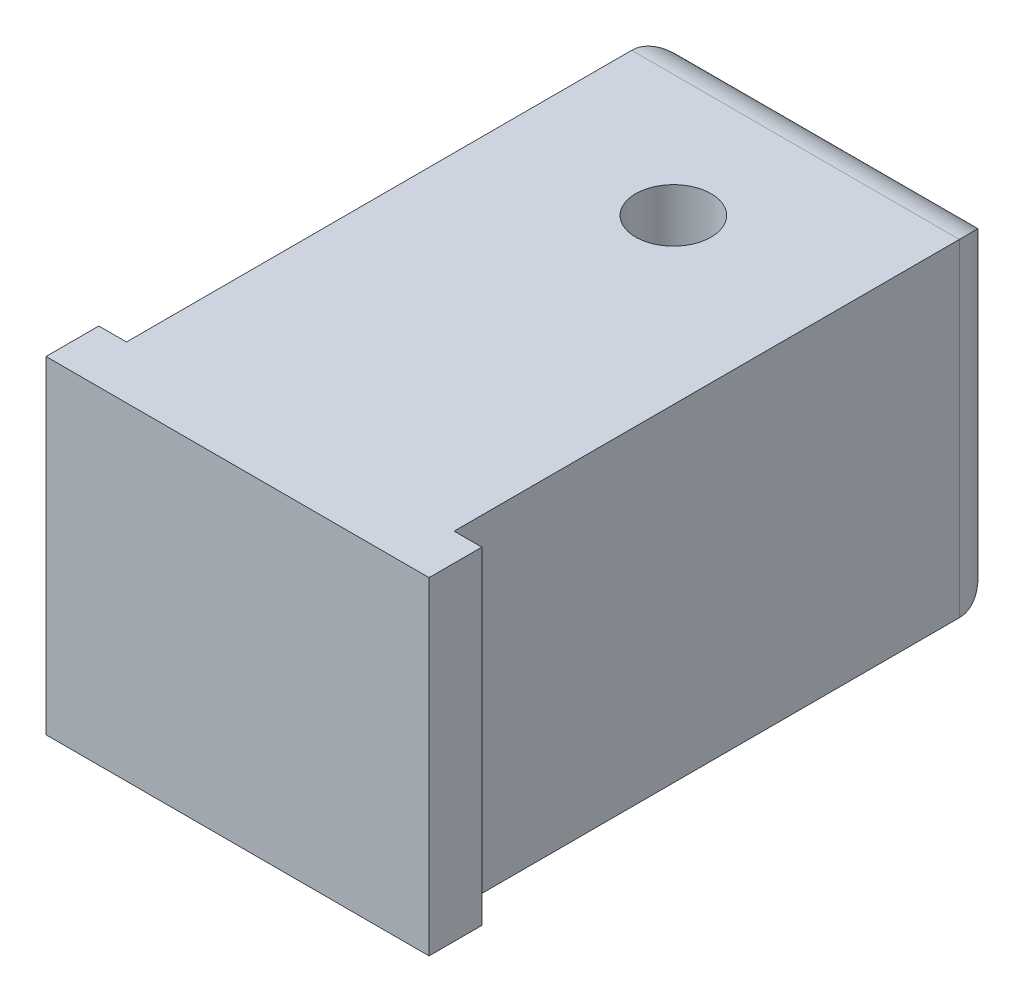
ISO-10303-21;
HEADER;
FILE_DESCRIPTION(('STEP AP214'),'2;1');
FILE_NAME('part.step','',(''),(''),'','','');
FILE_SCHEMA(('AUTOMOTIVE_DESIGN { 1 0 10303 214 1 1 1 1 }'));
ENDSEC;
DATA;
#1=APPLICATION_CONTEXT('core data for automotive mechanical design processes');
#2=APPLICATION_PROTOCOL_DEFINITION('international standard','automotive_design',2000,#1);
#3=PRODUCT_CONTEXT('',#1,'mechanical');
#4=PRODUCT('Part','Part','',(#3));
#5=PRODUCT_RELATED_PRODUCT_CATEGORY('part','',(#4));
#6=PRODUCT_DEFINITION_FORMATION('','',#4);
#7=PRODUCT_DEFINITION_CONTEXT('part definition',#1,'design');
#8=PRODUCT_DEFINITION('design','',#6,#7);
#9=PRODUCT_DEFINITION_SHAPE('','',#8);
#10=(LENGTH_UNIT() NAMED_UNIT(*) SI_UNIT(.MILLI.,.METRE.));
#11=(NAMED_UNIT(*) PLANE_ANGLE_UNIT() SI_UNIT($,.RADIAN.));
#12=(NAMED_UNIT(*) SI_UNIT($,.STERADIAN.) SOLID_ANGLE_UNIT());
#13=UNCERTAINTY_MEASURE_WITH_UNIT(LENGTH_MEASURE(1.E-05),#10,'distance_accuracy_value','');
#14=(GEOMETRIC_REPRESENTATION_CONTEXT(3) GLOBAL_UNCERTAINTY_ASSIGNED_CONTEXT((#13)) GLOBAL_UNIT_ASSIGNED_CONTEXT((#10,
#11,#12)) REPRESENTATION_CONTEXT('',''));
#15=CARTESIAN_POINT('',(0.,0.,0.));
#16=DIRECTION('',(0.,0.,1.));
#17=DIRECTION('',(1.,0.,0.));
#18=AXIS2_PLACEMENT_3D('',#15,#16,#17);
#19=CARTESIAN_POINT('',(23.8125,0.25,40.));
#20=DIRECTION('',(0.,0.,1.));
#21=DIRECTION('',(1.,0.,0.));
#22=AXIS2_PLACEMENT_3D('',#19,#20,#21);
#23=PLANE('',#22);
#24=DIRECTION('',(0.,1.,0.));
#25=VECTOR('',#24,1.);
#26=CARTESIAN_POINT('',(-1.5875,0.25,40.));
#27=LINE('',#26,#25);
#28=CARTESIAN_POINT('',(-1.5875,0.25,40.));
#29=VERTEX_POINT('',#28);
#30=CARTESIAN_POINT('',(-1.5875,21.975,40.));
#31=VERTEX_POINT('',#30);
#32=EDGE_CURVE('E219',#29,#31,#27,.T.);
#33=ORIENTED_EDGE('',*,*,#32,.F.);
#34=DIRECTION('',(1.,0.,0.));
#35=VECTOR('',#34,1.);
#36=CARTESIAN_POINT('',(-1.5875,0.25,40.));
#37=LINE('',#36,#35);
#38=CARTESIAN_POINT('',(23.8125,0.25,40.));
#39=VERTEX_POINT('',#38);
#40=EDGE_CURVE('E252',#29,#39,#37,.T.);
#41=ORIENTED_EDGE('',*,*,#40,.T.);
#42=DIRECTION('',(0.,1.,0.));
#43=VECTOR('',#42,1.);
#44=CARTESIAN_POINT('',(23.8125,0.25,40.));
#45=LINE('',#44,#43);
#46=CARTESIAN_POINT('',(23.8125,21.975,40.));
#47=VERTEX_POINT('',#46);
#48=EDGE_CURVE('E223',#39,#47,#45,.T.);
#49=ORIENTED_EDGE('',*,*,#48,.T.);
#50=DIRECTION('',(-1.,0.,0.));
#51=VECTOR('',#50,1.);
#52=CARTESIAN_POINT('',(16.54375,21.975,40.));
#53=LINE('',#52,#51);
#54=EDGE_CURVE('E220',#47,#31,#53,.T.);
#55=ORIENTED_EDGE('',*,*,#54,.T.);
#56=EDGE_LOOP('',(#33,#41,#49,#55));
#57=FACE_BOUND('',#56,.T.);
#58=ADVANCED_FACE('F42',(#57),#23,.T.);
#59=CARTESIAN_POINT('',(18.975,5.68125,3.));
#60=DIRECTION('',(0.,1.,0.));
#61=DIRECTION('',(0.707106781186548,0.,-0.707106781186547));
#62=AXIS2_PLACEMENT_3D('',#59,#60,#61);
#63=CYLINDRICAL_SURFACE('',#62,3.);
#64=DIRECTION('',(0.,-1.,0.));
#65=VECTOR('',#64,1.);
#66=CARTESIAN_POINT('',(21.975,5.68125,3.));
#67=LINE('',#66,#65);
#68=CARTESIAN_POINT('',(21.975,21.975,3.));
#69=VERTEX_POINT('',#68);
#70=CARTESIAN_POINT('',(21.975,0.25,3.));
#71=VERTEX_POINT('',#70);
#72=EDGE_CURVE('E175',#69,#71,#67,.T.);
#73=ORIENTED_EDGE('',*,*,#72,.T.);
#74=CARTESIAN_POINT('',(18.975,3.25,3.));
#75=DIRECTION('',(-0.707106781186547,-0.707106781186548,0.));
#76=DIRECTION('',(-0.707106781186548,0.707106781186547,0.));
#77=AXIS2_PLACEMENT_3D('',#74,#75,#76);
#78=ELLIPSE('',#77,4.24264068711929,3.);
#79=CARTESIAN_POINT('',(18.975,3.25,0.));
#80=VERTEX_POINT('',#79);
#81=EDGE_CURVE('E149',#80,#71,#78,.T.);
#82=ORIENTED_EDGE('',*,*,#81,.F.);
#83=DIRECTION('',(0.,1.,0.));
#84=VECTOR('',#83,1.);
#85=CARTESIAN_POINT('',(18.975,5.68125,0.));
#86=LINE('',#85,#84);
#87=CARTESIAN_POINT('',(18.975,18.975,0.));
#88=VERTEX_POINT('',#87);
#89=EDGE_CURVE('E251',#80,#88,#86,.T.);
#90=ORIENTED_EDGE('',*,*,#89,.T.);
#91=CARTESIAN_POINT('',(18.975,18.975,3.));
#92=DIRECTION('',(0.707106781186548,-0.707106781186548,0.));
#93=DIRECTION('',(-0.707106781186548,-0.707106781186548,0.));
#94=AXIS2_PLACEMENT_3D('',#91,#92,#93);
#95=ELLIPSE('',#94,4.24264068711929,3.);
#96=EDGE_CURVE('E178',#88,#69,#95,.T.);
#97=ORIENTED_EDGE('',*,*,#96,.T.);
#98=EDGE_LOOP('',(#73,#82,#90,#97));
#99=FACE_BOUND('',#98,.T.);
#100=ADVANCED_FACE('F176',(#99),#63,.T.);
#101=CARTESIAN_POINT('',(11.1125,11.1125,0.));
#102=DIRECTION('',(0.,0.,1.));
#103=DIRECTION('',(1.,0.,0.));
#104=AXIS2_PLACEMENT_3D('',#101,#102,#103);
#105=PLANE('',#104);
#106=DIRECTION('',(1.,0.,0.));
#107=VECTOR('',#106,1.);
#108=CARTESIAN_POINT('',(5.68125,3.25,0.));
#109=LINE('',#108,#107);
#110=CARTESIAN_POINT('',(3.25,3.25,0.));
#111=VERTEX_POINT('',#110);
#112=EDGE_CURVE('E156',#111,#80,#109,.T.);
#113=ORIENTED_EDGE('',*,*,#112,.F.);
#114=DIRECTION('',(0.,-1.,0.));
#115=VECTOR('',#114,1.);
#116=CARTESIAN_POINT('',(3.25,16.54375,0.));
#117=LINE('',#116,#115);
#118=CARTESIAN_POINT('',(3.25,18.975,0.));
#119=VERTEX_POINT('',#118);
#120=EDGE_CURVE('E161',#119,#111,#117,.T.);
#121=ORIENTED_EDGE('',*,*,#120,.F.);
#122=DIRECTION('',(-1.,0.,0.));
#123=VECTOR('',#122,1.);
#124=CARTESIAN_POINT('',(16.54375,18.975,0.));
#125=LINE('',#124,#123);
#126=EDGE_CURVE('E210',#88,#119,#125,.T.);
#127=ORIENTED_EDGE('',*,*,#126,.F.);
#128=ORIENTED_EDGE('',*,*,#89,.F.);
#129=EDGE_LOOP('',(#113,#121,#127,#128));
#130=FACE_BOUND('',#129,.T.);
#131=ADVANCED_FACE('F269',(#130),#105,.F.);
#132=CARTESIAN_POINT('',(3.25,16.54375,3.));
#133=DIRECTION('',(0.,-1.,0.));
#134=DIRECTION('',(-0.707106781186548,0.,-0.707106781186548));
#135=AXIS2_PLACEMENT_3D('',#132,#133,#134);
#136=CYLINDRICAL_SURFACE('',#135,3.);
#137=ORIENTED_EDGE('',*,*,#120,.T.);
#138=CARTESIAN_POINT('',(3.25,3.25,3.));
#139=DIRECTION('',(0.707106781186548,-0.707106781186547,0.));
#140=DIRECTION('',(-0.707106781186547,-0.707106781186548,0.));
#141=AXIS2_PLACEMENT_3D('',#138,#139,#140);
#142=ELLIPSE('',#141,4.24264068711929,3.);
#143=CARTESIAN_POINT('',(0.25,0.25,3.));
#144=VERTEX_POINT('',#143);
#145=EDGE_CURVE('E195',#144,#111,#142,.T.);
#146=ORIENTED_EDGE('',*,*,#145,.F.);
#147=DIRECTION('',(0.,1.,0.));
#148=VECTOR('',#147,1.);
#149=CARTESIAN_POINT('',(0.25,16.54375,3.));
#150=LINE('',#149,#148);
#151=CARTESIAN_POINT('',(0.25,21.975,3.));
#152=VERTEX_POINT('',#151);
#153=EDGE_CURVE('E207',#144,#152,#150,.T.);
#154=ORIENTED_EDGE('',*,*,#153,.T.);
#155=CARTESIAN_POINT('',(3.25,18.975,3.));
#156=DIRECTION('',(0.707106781186548,0.707106781186547,0.));
#157=DIRECTION('',(0.707106781186547,-0.707106781186548,0.));
#158=AXIS2_PLACEMENT_3D('',#155,#156,#157);
#159=ELLIPSE('',#158,4.24264068711928,3.);
#160=EDGE_CURVE('E228',#119,#152,#159,.T.);
#161=ORIENTED_EDGE('',*,*,#160,.F.);
#162=EDGE_LOOP('',(#137,#146,#154,#161));
#163=FACE_BOUND('',#162,.T.);
#164=ADVANCED_FACE('F265',(#163),#136,.T.);
#165=CARTESIAN_POINT('',(16.54375,18.975,3.));
#166=DIRECTION('',(-1.,0.,0.));
#167=DIRECTION('',(0.,0.707106781186548,-0.707106781186547));
#168=AXIS2_PLACEMENT_3D('',#165,#166,#167);
#169=CYLINDRICAL_SURFACE('',#168,3.);
#170=DIRECTION('',(1.,0.,0.));
#171=VECTOR('',#170,1.);
#172=CARTESIAN_POINT('',(16.54375,21.975,3.));
#173=LINE('',#172,#171);
#174=EDGE_CURVE('E213',#152,#69,#173,.T.);
#175=ORIENTED_EDGE('',*,*,#174,.T.);
#176=ORIENTED_EDGE('',*,*,#96,.F.);
#177=ORIENTED_EDGE('',*,*,#126,.T.);
#178=ORIENTED_EDGE('',*,*,#160,.T.);
#179=EDGE_LOOP('',(#175,#176,#177,#178));
#180=FACE_BOUND('',#179,.T.);
#181=ADVANCED_FACE('F344',(#180),#169,.T.);
#182=CARTESIAN_POINT('',(21.975,21.975,0.));
#183=DIRECTION('',(0.,1.,0.));
#184=DIRECTION('',(1.,0.,0.));
#185=AXIS2_PLACEMENT_3D('',#182,#183,#184);
#186=PLANE('',#185);
#187=CARTESIAN_POINT('',(11.1125,21.975,11.1));
#188=DIRECTION('',(0.,-1.,0.));
#189=DIRECTION('',(1.,0.,0.));
#190=AXIS2_PLACEMENT_3D('',#187,#188,#189);
#191=CIRCLE('',#190,2.5);
#192=CARTESIAN_POINT('',(8.6125,21.975,11.1));
#193=VERTEX_POINT('',#192);
#194=EDGE_CURVE('E11',#193,#193,#191,.T.);
#195=ORIENTED_EDGE('',*,*,#194,.T.);
#196=EDGE_LOOP('',(#195));
#197=FACE_BOUND('',#196,.T.);
#198=ORIENTED_EDGE('',*,*,#174,.F.);
#199=DIRECTION('',(0.,0.,1.));
#200=VECTOR('',#199,1.);
#201=CARTESIAN_POINT('',(0.25,21.975,0.));
#202=LINE('',#201,#200);
#203=CARTESIAN_POINT('',(0.25,21.975,36.5));
#204=VERTEX_POINT('',#203);
#205=EDGE_CURVE('E214',#152,#204,#202,.T.);
#206=ORIENTED_EDGE('',*,*,#205,.T.);
#207=DIRECTION('',(1.,0.,0.));
#208=VECTOR('',#207,1.);
#209=CARTESIAN_POINT('',(5.68125,21.975,36.5));
#210=LINE('',#209,#208);
#211=CARTESIAN_POINT('',(-1.5875,21.975,36.5));
#212=VERTEX_POINT('',#211);
#213=EDGE_CURVE('E204',#212,#204,#210,.T.);
#214=ORIENTED_EDGE('',*,*,#213,.F.);
#215=DIRECTION('',(0.,0.,-1.));
#216=VECTOR('',#215,1.);
#217=CARTESIAN_POINT('',(-1.5875,21.975,37.375));
#218=LINE('',#217,#216);
#219=EDGE_CURVE('E203',#31,#212,#218,.T.);
#220=ORIENTED_EDGE('',*,*,#219,.F.);
#221=ORIENTED_EDGE('',*,*,#54,.F.);
#222=DIRECTION('',(0.,0.,1.));
#223=VECTOR('',#222,1.);
#224=CARTESIAN_POINT('',(23.8125,21.975,39.125));
#225=LINE('',#224,#223);
#226=CARTESIAN_POINT('',(23.8125,21.975,36.5));
#227=VERTEX_POINT('',#226);
#228=EDGE_CURVE('E198',#227,#47,#225,.T.);
#229=ORIENTED_EDGE('',*,*,#228,.F.);
#230=DIRECTION('',(1.,0.,0.));
#231=VECTOR('',#230,1.);
#232=CARTESIAN_POINT('',(17.4625,21.975,36.5));
#233=LINE('',#232,#231);
#234=CARTESIAN_POINT('',(21.975,21.975,36.5));
#235=VERTEX_POINT('',#234);
#236=EDGE_CURVE('E224',#235,#227,#233,.T.);
#237=ORIENTED_EDGE('',*,*,#236,.F.);
#238=DIRECTION('',(0.,0.,1.));
#239=VECTOR('',#238,1.);
#240=CARTESIAN_POINT('',(21.975,21.975,0.));
#241=LINE('',#240,#239);
#242=EDGE_CURVE('E183',#69,#235,#241,.T.);
#243=ORIENTED_EDGE('',*,*,#242,.F.);
#244=EDGE_LOOP('',(#198,#206,#214,#220,#221,#229,#237,#243));
#245=FACE_BOUND('',#244,.T.);
#246=ADVANCED_FACE('F258',(#197,#245),#186,.T.);
#247=CARTESIAN_POINT('',(23.8125,0.25,40.));
#248=DIRECTION('',(1.,0.,0.));
#249=DIRECTION('',(0.,1.,0.));
#250=AXIS2_PLACEMENT_3D('',#247,#248,#249);
#251=PLANE('',#250);
#252=DIRECTION('',(0.,0.,-1.));
#253=VECTOR('',#252,1.);
#254=CARTESIAN_POINT('',(23.8125,0.25,40.));
#255=LINE('',#254,#253);
#256=CARTESIAN_POINT('',(23.8125,0.25,36.5));
#257=VERTEX_POINT('',#256);
#258=EDGE_CURVE('E254',#39,#257,#255,.T.);
#259=ORIENTED_EDGE('',*,*,#258,.T.);
#260=DIRECTION('',(0.,1.,0.));
#261=VECTOR('',#260,1.);
#262=CARTESIAN_POINT('',(23.8125,0.25,36.5));
#263=LINE('',#262,#261);
#264=EDGE_CURVE('E277',#257,#227,#263,.T.);
#265=ORIENTED_EDGE('',*,*,#264,.T.);
#266=ORIENTED_EDGE('',*,*,#228,.T.);
#267=ORIENTED_EDGE('',*,*,#48,.F.);
#268=EDGE_LOOP('',(#259,#265,#266,#267));
#269=FACE_BOUND('',#268,.T.);
#270=ADVANCED_FACE('F320',(#269),#251,.T.);
#271=CARTESIAN_POINT('',(23.8125,0.25,36.5));
#272=DIRECTION('',(0.,0.,-1.));
#273=DIRECTION('',(0.,-1.,0.));
#274=AXIS2_PLACEMENT_3D('',#271,#272,#273);
#275=PLANE('',#274);
#276=DIRECTION('',(-1.,0.,0.));
#277=VECTOR('',#276,1.);
#278=CARTESIAN_POINT('',(23.8125,0.25,36.5));
#279=LINE('',#278,#277);
#280=CARTESIAN_POINT('',(21.975,0.25,36.5));
#281=VERTEX_POINT('',#280);
#282=EDGE_CURVE('E141',#257,#281,#279,.T.);
#283=ORIENTED_EDGE('',*,*,#282,.T.);
#284=DIRECTION('',(0.,-1.,0.));
#285=VECTOR('',#284,1.);
#286=CARTESIAN_POINT('',(21.975,0.25,36.5));
#287=LINE('',#286,#285);
#288=EDGE_CURVE('E186',#235,#281,#287,.T.);
#289=ORIENTED_EDGE('',*,*,#288,.F.);
#290=ORIENTED_EDGE('',*,*,#236,.T.);
#291=ORIENTED_EDGE('',*,*,#264,.F.);
#292=EDGE_LOOP('',(#283,#289,#290,#291));
#293=FACE_BOUND('',#292,.T.);
#294=ADVANCED_FACE('F321',(#293),#275,.T.);
#295=CARTESIAN_POINT('',(21.975,0.25,0.));
#296=DIRECTION('',(1.,0.,0.));
#297=DIRECTION('',(0.,1.,0.));
#298=AXIS2_PLACEMENT_3D('',#295,#296,#297);
#299=PLANE('',#298);
#300=ORIENTED_EDGE('',*,*,#288,.T.);
#301=DIRECTION('',(0.,0.,1.));
#302=VECTOR('',#301,1.);
#303=CARTESIAN_POINT('',(21.975,0.25,0.));
#304=LINE('',#303,#302);
#305=EDGE_CURVE('E166',#71,#281,#304,.T.);
#306=ORIENTED_EDGE('',*,*,#305,.F.);
#307=ORIENTED_EDGE('',*,*,#72,.F.);
#308=ORIENTED_EDGE('',*,*,#242,.T.);
#309=EDGE_LOOP('',(#300,#306,#307,#308));
#310=FACE_BOUND('',#309,.T.);
#311=ADVANCED_FACE('F185',(#310),#299,.T.);
#312=CARTESIAN_POINT('',(5.68125,3.25,3.));
#313=DIRECTION('',(1.,0.,0.));
#314=DIRECTION('',(0.,-0.707106781186548,-0.707106781186548));
#315=AXIS2_PLACEMENT_3D('',#312,#313,#314);
#316=CYLINDRICAL_SURFACE('',#315,3.);
#317=DIRECTION('',(-1.,0.,0.));
#318=VECTOR('',#317,1.);
#319=CARTESIAN_POINT('',(5.68125,0.25,3.));
#320=LINE('',#319,#318);
#321=EDGE_CURVE('E153',#71,#144,#320,.T.);
#322=ORIENTED_EDGE('',*,*,#321,.T.);
#323=ORIENTED_EDGE('',*,*,#145,.T.);
#324=ORIENTED_EDGE('',*,*,#112,.T.);
#325=ORIENTED_EDGE('',*,*,#81,.T.);
#326=EDGE_LOOP('',(#322,#323,#324,#325));
#327=FACE_BOUND('',#326,.T.);
#328=ADVANCED_FACE('F151',(#327),#316,.T.);
#329=CARTESIAN_POINT('',(0.25,21.975,0.));
#330=DIRECTION('',(-1.,0.,0.));
#331=DIRECTION('',(0.,1.,0.));
#332=AXIS2_PLACEMENT_3D('',#329,#330,#331);
#333=PLANE('',#332);
#334=DIRECTION('',(0.,1.,0.));
#335=VECTOR('',#334,1.);
#336=CARTESIAN_POINT('',(0.25,11.1125,36.5));
#337=LINE('',#336,#335);
#338=CARTESIAN_POINT('',(0.25,0.25,36.5));
#339=VERTEX_POINT('',#338);
#340=EDGE_CURVE('E232',#339,#204,#337,.T.);
#341=ORIENTED_EDGE('',*,*,#340,.T.);
#342=ORIENTED_EDGE('',*,*,#205,.F.);
#343=ORIENTED_EDGE('',*,*,#153,.F.);
#344=DIRECTION('',(0.,0.,1.));
#345=VECTOR('',#344,1.);
#346=CARTESIAN_POINT('',(0.25,0.25,0.));
#347=LINE('',#346,#345);
#348=EDGE_CURVE('E170',#144,#339,#347,.T.);
#349=ORIENTED_EDGE('',*,*,#348,.T.);
#350=EDGE_LOOP('',(#341,#342,#343,#349));
#351=FACE_BOUND('',#350,.T.);
#352=ADVANCED_FACE('F261',(#351),#333,.T.);
#353=CARTESIAN_POINT('',(0.25,0.25,36.5));
#354=DIRECTION('',(0.,0.,-1.));
#355=DIRECTION('',(0.,-1.,0.));
#356=AXIS2_PLACEMENT_3D('',#353,#354,#355);
#357=PLANE('',#356);
#358=DIRECTION('',(-1.,0.,0.));
#359=VECTOR('',#358,1.);
#360=CARTESIAN_POINT('',(23.8125,0.25,36.5));
#361=LINE('',#360,#359);
#362=CARTESIAN_POINT('',(-1.5875,0.25,36.5));
#363=VERTEX_POINT('',#362);
#364=EDGE_CURVE('E292',#339,#363,#361,.T.);
#365=ORIENTED_EDGE('',*,*,#364,.T.);
#366=DIRECTION('',(0.,1.,0.));
#367=VECTOR('',#366,1.);
#368=CARTESIAN_POINT('',(-1.5875,0.25,36.5));
#369=LINE('',#368,#367);
#370=EDGE_CURVE('E199',#363,#212,#369,.T.);
#371=ORIENTED_EDGE('',*,*,#370,.T.);
#372=ORIENTED_EDGE('',*,*,#213,.T.);
#373=ORIENTED_EDGE('',*,*,#340,.F.);
#374=EDGE_LOOP('',(#365,#371,#372,#373));
#375=FACE_BOUND('',#374,.T.);
#376=ADVANCED_FACE('F348',(#375),#357,.T.);
#377=CARTESIAN_POINT('',(-1.5875,0.25,36.5));
#378=DIRECTION('',(-1.,0.,0.));
#379=DIRECTION('',(0.,0.,1.));
#380=AXIS2_PLACEMENT_3D('',#377,#378,#379);
#381=PLANE('',#380);
#382=DIRECTION('',(0.,0.,1.));
#383=VECTOR('',#382,1.);
#384=CARTESIAN_POINT('',(-1.5875,0.25,0.));
#385=LINE('',#384,#383);
#386=EDGE_CURVE('E46',#363,#29,#385,.T.);
#387=ORIENTED_EDGE('',*,*,#386,.T.);
#388=ORIENTED_EDGE('',*,*,#32,.T.);
#389=ORIENTED_EDGE('',*,*,#219,.T.);
#390=ORIENTED_EDGE('',*,*,#370,.F.);
#391=EDGE_LOOP('',(#387,#388,#389,#390));
#392=FACE_BOUND('',#391,.T.);
#393=ADVANCED_FACE('F305',(#392),#381,.T.);
#394=CARTESIAN_POINT('',(11.1125,21.975,11.1));
#395=DIRECTION('',(0.,-1.,0.));
#396=DIRECTION('',(1.,0.,0.));
#397=AXIS2_PLACEMENT_3D('',#394,#395,#396);
#398=CYLINDRICAL_SURFACE('',#397,2.5);
#399=ORIENTED_EDGE('',*,*,#194,.F.);
#400=DIRECTION('',(0.,-1.,0.));
#401=VECTOR('',#400,1.);
#402=CARTESIAN_POINT('',(8.6125,21.975,11.1));
#403=LINE('',#402,#401);
#404=CARTESIAN_POINT('',(8.6125,0.249999999999995,11.1));
#405=VERTEX_POINT('',#404);
#406=EDGE_CURVE('E53',#193,#405,#403,.T.);
#407=ORIENTED_EDGE('',*,*,#406,.T.);
#408=CARTESIAN_POINT('',(11.1125,0.249999999999995,11.1));
#409=DIRECTION('',(0.,1.,0.));
#410=DIRECTION('',(1.,0.,0.));
#411=AXIS2_PLACEMENT_3D('',#408,#409,#410);
#412=CIRCLE('',#411,2.5);
#413=EDGE_CURVE('E191',#405,#405,#412,.T.);
#414=ORIENTED_EDGE('',*,*,#413,.F.);
#415=ORIENTED_EDGE('',*,*,#406,.F.);
#416=EDGE_LOOP('',(#399,#407,#414,#415));
#417=FACE_BOUND('',#416,.T.);
#418=ADVANCED_FACE('F347',(#417),#398,.F.);
#419=CARTESIAN_POINT('',(0.25,0.25,0.));
#420=DIRECTION('',(0.,-1.,0.));
#421=DIRECTION('',(0.,0.,-1.));
#422=AXIS2_PLACEMENT_3D('',#419,#420,#421);
#423=PLANE('',#422);
#424=ORIENTED_EDGE('',*,*,#413,.T.);
#425=EDGE_LOOP('',(#424));
#426=FACE_BOUND('',#425,.T.);
#427=ORIENTED_EDGE('',*,*,#40,.F.);
#428=ORIENTED_EDGE('',*,*,#386,.F.);
#429=ORIENTED_EDGE('',*,*,#364,.F.);
#430=ORIENTED_EDGE('',*,*,#348,.F.);
#431=ORIENTED_EDGE('',*,*,#321,.F.);
#432=ORIENTED_EDGE('',*,*,#305,.T.);
#433=ORIENTED_EDGE('',*,*,#282,.F.);
#434=ORIENTED_EDGE('',*,*,#258,.F.);
#435=EDGE_LOOP('',(#427,#428,#429,#430,#431,#432,#433,#434));
#436=FACE_BOUND('',#435,.T.);
#437=ADVANCED_FACE('F44',(#426,#436),#423,.T.);
#438=CLOSED_SHELL('',(#58,#100,#131,#164,#181,#246,#270,#294,#311,#328,#352,#376,#393,#418,#437));
#439=MANIFOLD_SOLID_BREP('B2',#438);
#440=ADVANCED_BREP_SHAPE_REPRESENTATION('',(#18,#439),#14);
#441=SHAPE_DEFINITION_REPRESENTATION(#9,#440);
ENDSEC;
END-ISO-10303-21;
